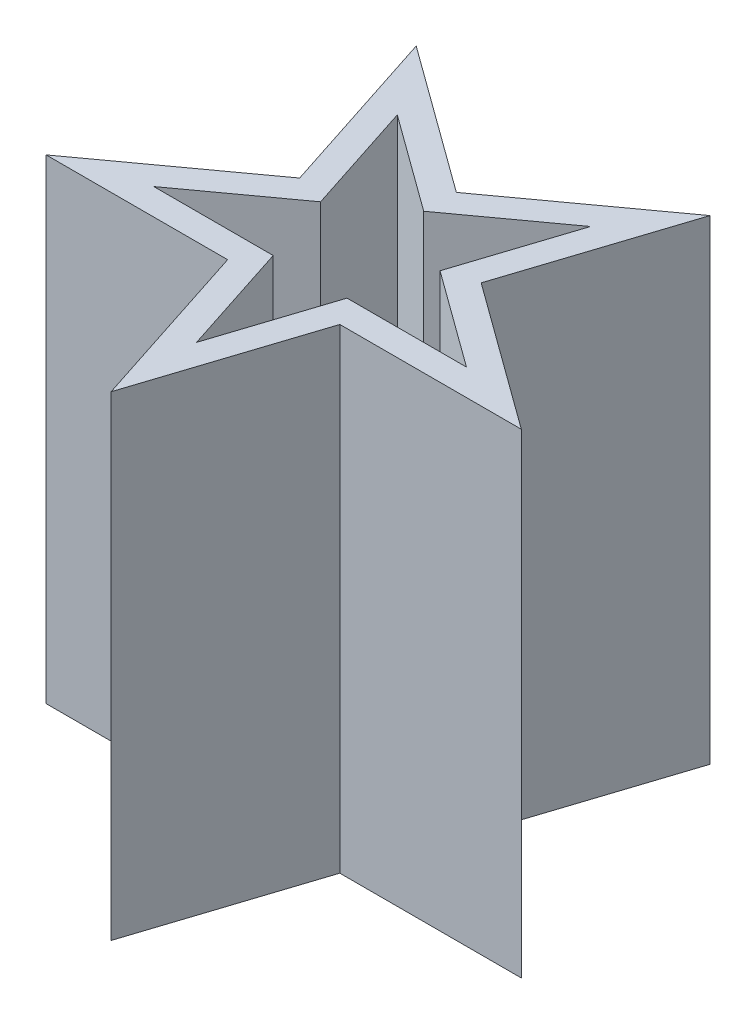
ISO-10303-21;
HEADER;
FILE_DESCRIPTION(('STEP AP214'),'2;1');
FILE_NAME('part.step','',(''),(''),'','','');
FILE_SCHEMA(('AUTOMOTIVE_DESIGN { 1 0 10303 214 1 1 1 1 }'));
ENDSEC;
DATA;
#1=APPLICATION_CONTEXT('core data for automotive mechanical design processes');
#2=APPLICATION_PROTOCOL_DEFINITION('international standard','automotive_design',2000,#1);
#3=PRODUCT_CONTEXT('',#1,'mechanical');
#4=PRODUCT('Part','Part','',(#3));
#5=PRODUCT_RELATED_PRODUCT_CATEGORY('part','',(#4));
#6=PRODUCT_DEFINITION_FORMATION('','',#4);
#7=PRODUCT_DEFINITION_CONTEXT('part definition',#1,'design');
#8=PRODUCT_DEFINITION('design','',#6,#7);
#9=PRODUCT_DEFINITION_SHAPE('','',#8);
#10=(LENGTH_UNIT() NAMED_UNIT(*) SI_UNIT(.MILLI.,.METRE.));
#11=(NAMED_UNIT(*) PLANE_ANGLE_UNIT() SI_UNIT($,.RADIAN.));
#12=(NAMED_UNIT(*) SI_UNIT($,.STERADIAN.) SOLID_ANGLE_UNIT());
#13=UNCERTAINTY_MEASURE_WITH_UNIT(LENGTH_MEASURE(1.E-05),#10,'distance_accuracy_value','');
#14=(GEOMETRIC_REPRESENTATION_CONTEXT(3) GLOBAL_UNCERTAINTY_ASSIGNED_CONTEXT((#13)) GLOBAL_UNIT_ASSIGNED_CONTEXT((#10,
#11,#12)) REPRESENTATION_CONTEXT('',''));
#15=CARTESIAN_POINT('',(0.,0.,0.));
#16=DIRECTION('',(0.,0.,1.));
#17=DIRECTION('',(1.,0.,0.));
#18=AXIS2_PLACEMENT_3D('',#15,#16,#17);
#19=CARTESIAN_POINT('',(0.,18.,9.4631600181444));
#20=DIRECTION('',(0.951056516295154,0.,-0.309016994374948));
#21=DIRECTION('',(-0.309016994374948,0.,-0.951056516295154));
#22=AXIS2_PLACEMENT_3D('',#19,#20,#21);
#23=PLANE('',#22);
#24=DIRECTION('',(0.309016994374948,0.,0.951056516295154));
#25=VECTOR('',#24,1.);
#26=CARTESIAN_POINT('',(0.,0.,9.4631600181444));
#27=LINE('',#26,#25);
#28=CARTESIAN_POINT('',(-2.12461179749811,0.,2.92427726609615));
#29=VERTEX_POINT('',#28);
#30=CARTESIAN_POINT('',(0.,0.,9.4631600181444));
#31=VERTEX_POINT('',#30);
#32=EDGE_CURVE('E165',#29,#31,#27,.T.);
#33=ORIENTED_EDGE('',*,*,#32,.T.);
#34=DIRECTION('',(0.,-1.,0.));
#35=VECTOR('',#34,1.);
#36=CARTESIAN_POINT('',(0.,18.,9.4631600181444));
#37=LINE('',#36,#35);
#38=CARTESIAN_POINT('',(0.,18.,9.4631600181444));
#39=VERTEX_POINT('',#38);
#40=EDGE_CURVE('E11',#39,#31,#37,.T.);
#41=ORIENTED_EDGE('',*,*,#40,.F.);
#42=DIRECTION('',(0.309016994374948,0.,0.951056516295154));
#43=VECTOR('',#42,1.);
#44=CARTESIAN_POINT('',(0.,18.,9.4631600181444));
#45=LINE('',#44,#43);
#46=CARTESIAN_POINT('',(-2.12461179749811,18.,2.92427726609615));
#47=VERTEX_POINT('',#46);
#48=EDGE_CURVE('E195',#47,#39,#45,.T.);
#49=ORIENTED_EDGE('',*,*,#48,.F.);
#50=DIRECTION('',(0.,-1.,0.));
#51=VECTOR('',#50,1.);
#52=CARTESIAN_POINT('',(-2.12461179749811,18.,2.92427726609615));
#53=LINE('',#52,#51);
#54=EDGE_CURVE('E161',#47,#29,#53,.T.);
#55=ORIENTED_EDGE('',*,*,#54,.T.);
#56=EDGE_LOOP('',(#33,#41,#49,#55));
#57=FACE_BOUND('',#56,.T.);
#58=ADVANCED_FACE('F41',(#57),#23,.F.);
#59=CARTESIAN_POINT('',(2.12461179749811,18.,2.92427726609615));
#60=DIRECTION('',(-0.951056516295154,0.,-0.309016994374947));
#61=DIRECTION('',(-0.309016994374948,0.,0.951056516295154));
#62=AXIS2_PLACEMENT_3D('',#59,#60,#61);
#63=PLANE('',#62);
#64=DIRECTION('',(0.309016994374947,0.,-0.951056516295154));
#65=VECTOR('',#64,1.);
#66=CARTESIAN_POINT('',(2.12461179749811,0.,2.92427726609615));
#67=LINE('',#66,#65);
#68=CARTESIAN_POINT('',(2.12461179749811,0.,2.92427726609615));
#69=VERTEX_POINT('',#68);
#70=EDGE_CURVE('E169',#31,#69,#67,.T.);
#71=ORIENTED_EDGE('',*,*,#70,.T.);
#72=DIRECTION('',(0.,-1.,0.));
#73=VECTOR('',#72,1.);
#74=CARTESIAN_POINT('',(2.12461179749811,18.,2.92427726609615));
#75=LINE('',#74,#73);
#76=CARTESIAN_POINT('',(2.12461179749811,18.,2.92427726609615));
#77=VERTEX_POINT('',#76);
#78=EDGE_CURVE('E49',#77,#69,#75,.T.);
#79=ORIENTED_EDGE('',*,*,#78,.F.);
#80=DIRECTION('',(0.309016994374947,0.,-0.951056516295154));
#81=VECTOR('',#80,1.);
#82=CARTESIAN_POINT('',(2.12461179749811,18.,2.92427726609615));
#83=LINE('',#82,#81);
#84=EDGE_CURVE('E112',#39,#77,#83,.T.);
#85=ORIENTED_EDGE('',*,*,#84,.F.);
#86=ORIENTED_EDGE('',*,*,#40,.T.);
#87=EDGE_LOOP('',(#71,#79,#85,#86));
#88=FACE_BOUND('',#87,.T.);
#89=ADVANCED_FACE('F449',(#88),#63,.F.);
#90=CARTESIAN_POINT('',(8.99999999999999,18.,2.92427726609615));
#91=DIRECTION('',(0.,0.,-1.));
#92=DIRECTION('',(-1.,0.,0.));
#93=AXIS2_PLACEMENT_3D('',#90,#91,#92);
#94=PLANE('',#93);
#95=DIRECTION('',(1.,0.,0.));
#96=VECTOR('',#95,1.);
#97=CARTESIAN_POINT('',(8.99999999999999,0.,2.92427726609615));
#98=LINE('',#97,#96);
#99=CARTESIAN_POINT('',(8.99999999999999,0.,2.92427726609615));
#100=VERTEX_POINT('',#99);
#101=EDGE_CURVE('E173',#69,#100,#98,.T.);
#102=ORIENTED_EDGE('',*,*,#101,.T.);
#103=DIRECTION('',(0.,-1.,0.));
#104=VECTOR('',#103,1.);
#105=CARTESIAN_POINT('',(8.99999999999999,18.,2.92427726609615));
#106=LINE('',#105,#104);
#107=CARTESIAN_POINT('',(8.99999999999999,18.,2.92427726609615));
#108=VERTEX_POINT('',#107);
#109=EDGE_CURVE('E214',#108,#100,#106,.T.);
#110=ORIENTED_EDGE('',*,*,#109,.F.);
#111=DIRECTION('',(1.,0.,0.));
#112=VECTOR('',#111,1.);
#113=CARTESIAN_POINT('',(8.99999999999999,18.,2.92427726609615));
#114=LINE('',#113,#112);
#115=EDGE_CURVE('E224',#77,#108,#114,.T.);
#116=ORIENTED_EDGE('',*,*,#115,.F.);
#117=ORIENTED_EDGE('',*,*,#78,.T.);
#118=EDGE_LOOP('',(#102,#110,#116,#117));
#119=FACE_BOUND('',#118,.T.);
#120=ADVANCED_FACE('F222',(#119),#94,.F.);
#121=CARTESIAN_POINT('',(3.43769410125095,18.,-1.11697452312008));
#122=DIRECTION('',(-0.587785252292471,0.,0.809016994374949));
#123=DIRECTION('',(0.809016994374949,0.,0.587785252292471));
#124=AXIS2_PLACEMENT_3D('',#121,#122,#123);
#125=PLANE('',#124);
#126=DIRECTION('',(-0.809016994374949,0.,-0.587785252292471));
#127=VECTOR('',#126,1.);
#128=CARTESIAN_POINT('',(3.43769410125095,0.,-1.11697452312008));
#129=LINE('',#128,#127);
#130=CARTESIAN_POINT('',(3.43769410125095,0.,-1.11697452312008));
#131=VERTEX_POINT('',#130);
#132=EDGE_CURVE('E176',#100,#131,#129,.T.);
#133=ORIENTED_EDGE('',*,*,#132,.T.);
#134=DIRECTION('',(0.,-1.,0.));
#135=VECTOR('',#134,1.);
#136=CARTESIAN_POINT('',(3.43769410125095,18.,-1.11697452312008));
#137=LINE('',#136,#135);
#138=CARTESIAN_POINT('',(3.43769410125095,18.,-1.11697452312008));
#139=VERTEX_POINT('',#138);
#140=EDGE_CURVE('E210',#139,#131,#137,.T.);
#141=ORIENTED_EDGE('',*,*,#140,.F.);
#142=DIRECTION('',(-0.809016994374949,0.,-0.587785252292471));
#143=VECTOR('',#142,1.);
#144=CARTESIAN_POINT('',(3.43769410125095,18.,-1.11697452312008));
#145=LINE('',#144,#143);
#146=EDGE_CURVE('E243',#108,#139,#145,.T.);
#147=ORIENTED_EDGE('',*,*,#146,.F.);
#148=ORIENTED_EDGE('',*,*,#109,.T.);
#149=EDGE_LOOP('',(#133,#141,#147,#148));
#150=FACE_BOUND('',#149,.T.);
#151=ADVANCED_FACE('F233',(#150),#125,.F.);
#152=CARTESIAN_POINT('',(5.56230589874905,18.,-7.65585727516836));
#153=DIRECTION('',(-0.951056516295155,0.,-0.309016994374945));
#154=DIRECTION('',(-0.309016994374945,0.,0.951056516295155));
#155=AXIS2_PLACEMENT_3D('',#152,#153,#154);
#156=PLANE('',#155);
#157=DIRECTION('',(0.309016994374945,0.,-0.951056516295154));
#158=VECTOR('',#157,1.);
#159=CARTESIAN_POINT('',(5.56230589874905,0.,-7.65585727516836));
#160=LINE('',#159,#158);
#161=CARTESIAN_POINT('',(5.56230589874905,0.,-7.65585727516836));
#162=VERTEX_POINT('',#161);
#163=EDGE_CURVE('E179',#131,#162,#160,.T.);
#164=ORIENTED_EDGE('',*,*,#163,.T.);
#165=DIRECTION('',(0.,-1.,0.));
#166=VECTOR('',#165,1.);
#167=CARTESIAN_POINT('',(5.56230589874905,18.,-7.65585727516836));
#168=LINE('',#167,#166);
#169=CARTESIAN_POINT('',(5.56230589874905,18.,-7.65585727516836));
#170=VERTEX_POINT('',#169);
#171=EDGE_CURVE('E206',#170,#162,#168,.T.);
#172=ORIENTED_EDGE('',*,*,#171,.F.);
#173=DIRECTION('',(0.309016994374945,0.,-0.951056516295154));
#174=VECTOR('',#173,1.);
#175=CARTESIAN_POINT('',(5.56230589874905,18.,-7.65585727516836));
#176=LINE('',#175,#174);
#177=EDGE_CURVE('E239',#139,#170,#176,.T.);
#178=ORIENTED_EDGE('',*,*,#177,.F.);
#179=ORIENTED_EDGE('',*,*,#140,.T.);
#180=EDGE_LOOP('',(#164,#172,#178,#179));
#181=FACE_BOUND('',#180,.T.);
#182=ADVANCED_FACE('F237',(#181),#156,.F.);
#183=CARTESIAN_POINT('',(0.,18.,-3.61460548595209));
#184=DIRECTION('',(0.587785252292473,0.,0.809016994374947));
#185=DIRECTION('',(0.809016994374947,0.,-0.587785252292473));
#186=AXIS2_PLACEMENT_3D('',#183,#184,#185);
#187=PLANE('',#186);
#188=DIRECTION('',(-0.809016994374947,0.,0.587785252292473));
#189=VECTOR('',#188,1.);
#190=CARTESIAN_POINT('',(0.,0.,-3.61460548595209));
#191=LINE('',#190,#189);
#192=CARTESIAN_POINT('',(0.,0.,-3.61460548595209));
#193=VERTEX_POINT('',#192);
#194=EDGE_CURVE('E182',#162,#193,#191,.T.);
#195=ORIENTED_EDGE('',*,*,#194,.T.);
#196=DIRECTION('',(0.,-1.,0.));
#197=VECTOR('',#196,1.);
#198=CARTESIAN_POINT('',(0.,18.,-3.61460548595209));
#199=LINE('',#198,#197);
#200=CARTESIAN_POINT('',(0.,18.,-3.61460548595209));
#201=VERTEX_POINT('',#200);
#202=EDGE_CURVE('E202',#201,#193,#199,.T.);
#203=ORIENTED_EDGE('',*,*,#202,.F.);
#204=DIRECTION('',(-0.809016994374947,0.,0.587785252292473));
#205=VECTOR('',#204,1.);
#206=CARTESIAN_POINT('',(0.,18.,-3.61460548595209));
#207=LINE('',#206,#205);
#208=EDGE_CURVE('E242',#170,#201,#207,.T.);
#209=ORIENTED_EDGE('',*,*,#208,.F.);
#210=ORIENTED_EDGE('',*,*,#171,.T.);
#211=EDGE_LOOP('',(#195,#203,#209,#210));
#212=FACE_BOUND('',#211,.T.);
#213=ADVANCED_FACE('F473',(#212),#187,.F.);
#214=CARTESIAN_POINT('',(-5.56230589874905,18.,-7.65585727516835));
#215=DIRECTION('',(-0.587785252292473,0.,0.809016994374948));
#216=DIRECTION('',(0.809016994374948,0.,0.587785252292473));
#217=AXIS2_PLACEMENT_3D('',#214,#215,#216);
#218=PLANE('',#217);
#219=DIRECTION('',(-0.809016994374948,0.,-0.587785252292473));
#220=VECTOR('',#219,1.);
#221=CARTESIAN_POINT('',(-5.56230589874905,0.,-7.65585727516835));
#222=LINE('',#221,#220);
#223=CARTESIAN_POINT('',(-5.56230589874905,0.,-7.65585727516835));
#224=VERTEX_POINT('',#223);
#225=EDGE_CURVE('E185',#193,#224,#222,.T.);
#226=ORIENTED_EDGE('',*,*,#225,.T.);
#227=DIRECTION('',(0.,-1.,0.));
#228=VECTOR('',#227,1.);
#229=CARTESIAN_POINT('',(-5.56230589874905,18.,-7.65585727516835));
#230=LINE('',#229,#228);
#231=CARTESIAN_POINT('',(-5.56230589874905,18.,-7.65585727516835));
#232=VERTEX_POINT('',#231);
#233=EDGE_CURVE('E154',#232,#224,#230,.T.);
#234=ORIENTED_EDGE('',*,*,#233,.F.);
#235=DIRECTION('',(-0.809016994374948,0.,-0.587785252292473));
#236=VECTOR('',#235,1.);
#237=CARTESIAN_POINT('',(-5.56230589874905,18.,-7.65585727516835));
#238=LINE('',#237,#236);
#239=EDGE_CURVE('E140',#201,#232,#238,.T.);
#240=ORIENTED_EDGE('',*,*,#239,.F.);
#241=ORIENTED_EDGE('',*,*,#202,.T.);
#242=EDGE_LOOP('',(#226,#234,#240,#241));
#243=FACE_BOUND('',#242,.T.);
#244=ADVANCED_FACE('F470',(#243),#218,.F.);
#245=CARTESIAN_POINT('',(-3.43769410125094,18.,-1.11697452312012));
#246=DIRECTION('',(0.951056516295153,0.,-0.309016994374949));
#247=DIRECTION('',(-0.309016994374949,0.,-0.951056516295153));
#248=AXIS2_PLACEMENT_3D('',#245,#246,#247);
#249=PLANE('',#248);
#250=DIRECTION('',(0.309016994374948,0.,0.951056516295153));
#251=VECTOR('',#250,1.);
#252=CARTESIAN_POINT('',(-3.43769410125094,0.,-1.11697452312012));
#253=LINE('',#252,#251);
#254=CARTESIAN_POINT('',(-3.43769410125094,0.,-1.11697452312012));
#255=VERTEX_POINT('',#254);
#256=EDGE_CURVE('E150',#224,#255,#253,.T.);
#257=ORIENTED_EDGE('',*,*,#256,.T.);
#258=DIRECTION('',(0.,-1.,0.));
#259=VECTOR('',#258,1.);
#260=CARTESIAN_POINT('',(-3.43769410125094,18.,-1.11697452312012));
#261=LINE('',#260,#259);
#262=CARTESIAN_POINT('',(-3.43769410125094,18.,-1.11697452312012));
#263=VERTEX_POINT('',#262);
#264=EDGE_CURVE('E147',#263,#255,#261,.T.);
#265=ORIENTED_EDGE('',*,*,#264,.F.);
#266=DIRECTION('',(0.309016994374948,0.,0.951056516295153));
#267=VECTOR('',#266,1.);
#268=CARTESIAN_POINT('',(-3.43769410125094,18.,-1.11697452312012));
#269=LINE('',#268,#267);
#270=EDGE_CURVE('E133',#232,#263,#269,.T.);
#271=ORIENTED_EDGE('',*,*,#270,.F.);
#272=ORIENTED_EDGE('',*,*,#233,.T.);
#273=EDGE_LOOP('',(#257,#265,#271,#272));
#274=FACE_BOUND('',#273,.T.);
#275=ADVANCED_FACE('F148',(#274),#249,.F.);
#276=CARTESIAN_POINT('',(-9.00000000000001,18.,2.92427726609613));
#277=DIRECTION('',(0.587785252292471,0.,0.809016994374949));
#278=DIRECTION('',(0.809016994374949,0.,-0.587785252292471));
#279=AXIS2_PLACEMENT_3D('',#276,#277,#278);
#280=PLANE('',#279);
#281=DIRECTION('',(-0.809016994374949,0.,0.587785252292471));
#282=VECTOR('',#281,1.);
#283=CARTESIAN_POINT('',(-9.00000000000001,0.,2.92427726609613));
#284=LINE('',#283,#282);
#285=CARTESIAN_POINT('',(-9.00000000000001,0.,2.92427726609613));
#286=VERTEX_POINT('',#285);
#287=EDGE_CURVE('E190',#255,#286,#284,.T.);
#288=ORIENTED_EDGE('',*,*,#287,.T.);
#289=DIRECTION('',(0.,-1.,0.));
#290=VECTOR('',#289,1.);
#291=CARTESIAN_POINT('',(-9.00000000000001,18.,2.92427726609613));
#292=LINE('',#291,#290);
#293=CARTESIAN_POINT('',(-9.00000000000001,18.,2.92427726609613));
#294=VERTEX_POINT('',#293);
#295=EDGE_CURVE('E155',#294,#286,#292,.T.);
#296=ORIENTED_EDGE('',*,*,#295,.F.);
#297=DIRECTION('',(-0.809016994374949,0.,0.587785252292471));
#298=VECTOR('',#297,1.);
#299=CARTESIAN_POINT('',(-9.00000000000001,18.,2.92427726609613));
#300=LINE('',#299,#298);
#301=EDGE_CURVE('E137',#263,#294,#300,.T.);
#302=ORIENTED_EDGE('',*,*,#301,.F.);
#303=ORIENTED_EDGE('',*,*,#264,.T.);
#304=EDGE_LOOP('',(#288,#296,#302,#303));
#305=FACE_BOUND('',#304,.T.);
#306=ADVANCED_FACE('F157',(#305),#280,.F.);
#307=CARTESIAN_POINT('',(-2.12461179749811,18.,2.92427726609615));
#308=DIRECTION('',(0.,0.,-1.));
#309=DIRECTION('',(-1.,0.,0.));
#310=AXIS2_PLACEMENT_3D('',#307,#308,#309);
#311=PLANE('',#310);
#312=DIRECTION('',(1.,0.,0.));
#313=VECTOR('',#312,1.);
#314=CARTESIAN_POINT('',(-2.12461179749811,0.,2.92427726609615));
#315=LINE('',#314,#313);
#316=EDGE_CURVE('E104',#286,#29,#315,.T.);
#317=ORIENTED_EDGE('',*,*,#316,.T.);
#318=ORIENTED_EDGE('',*,*,#54,.F.);
#319=DIRECTION('',(1.,0.,0.));
#320=VECTOR('',#319,1.);
#321=CARTESIAN_POINT('',(-2.12461179749811,18.,2.92427726609615));
#322=LINE('',#321,#320);
#323=EDGE_CURVE('E65',#294,#47,#322,.T.);
#324=ORIENTED_EDGE('',*,*,#323,.F.);
#325=ORIENTED_EDGE('',*,*,#295,.T.);
#326=EDGE_LOOP('',(#317,#318,#324,#325));
#327=FACE_BOUND('',#326,.T.);
#328=ADVANCED_FACE('F457',(#327),#311,.F.);
#329=CARTESIAN_POINT('',(0.,18.,0.));
#330=DIRECTION('',(0.,1.,0.));
#331=DIRECTION('',(0.,0.,1.));
#332=AXIS2_PLACEMENT_3D('',#329,#330,#331);
#333=PLANE('',#332);
#334=DIRECTION('',(0.309016994374948,0.,0.951056516295154));
#335=VECTOR('',#334,1.);
#336=CARTESIAN_POINT('',(0.951056516295154,18.,9.15414302376945));
#337=LINE('',#336,#335);
#338=CARTESIAN_POINT('',(-1.39806926949274,18.,1.92427726609616));
#339=VERTEX_POINT('',#338);
#340=CARTESIAN_POINT('',(0.,18.,6.22709204064461));
#341=VERTEX_POINT('',#340);
#342=EDGE_CURVE('E292',#339,#341,#337,.T.);
#343=ORIENTED_EDGE('',*,*,#342,.F.);
#344=DIRECTION('',(1.,0.,0.));
#345=VECTOR('',#344,1.);
#346=CARTESIAN_POINT('',(-2.1246117974981,18.,1.92427726609615));
#347=LINE('',#346,#345);
#348=CARTESIAN_POINT('',(-5.92231646282475,18.,1.92427726609614));
#349=VERTEX_POINT('',#348);
#350=EDGE_CURVE('E257',#349,#339,#347,.T.);
#351=ORIENTED_EDGE('',*,*,#350,.F.);
#352=DIRECTION('',(-0.809016994374949,0.,0.587785252292471));
#353=VECTOR('',#352,1.);
#354=CARTESIAN_POINT('',(-8.41221474770753,18.,3.73329426047108));
#355=LINE('',#354,#353);
#356=CARTESIAN_POINT('',(-2.26212359666599,18.,-0.735008511870014));
#357=VERTEX_POINT('',#356);
#358=EDGE_CURVE('E261',#357,#349,#355,.T.);
#359=ORIENTED_EDGE('',*,*,#358,.F.);
#360=DIRECTION('',(0.309016994374949,0.,0.951056516295153));
#361=VECTOR('',#360,1.);
#362=CARTESIAN_POINT('',(-2.48663758495579,18.,-1.42599151749507));
#363=LINE('',#362,#361);
#364=CARTESIAN_POINT('',(-3.66019286615874,18.,-5.03782328641846));
#365=VERTEX_POINT('',#364);
#366=EDGE_CURVE('E264',#365,#357,#363,.T.);
#367=ORIENTED_EDGE('',*,*,#366,.F.);
#368=DIRECTION('',(-0.809016994374948,0.,-0.587785252292473));
#369=VECTOR('',#368,1.);
#370=CARTESIAN_POINT('',(-6.15009115104152,18.,-6.84684028079341));
#371=LINE('',#370,#369);
#372=CARTESIAN_POINT('',(0.,18.,-2.3785375084523));
#373=VERTEX_POINT('',#372);
#374=EDGE_CURVE('E268',#373,#365,#371,.T.);
#375=ORIENTED_EDGE('',*,*,#374,.F.);
#376=DIRECTION('',(-0.809016994374947,0.,0.587785252292473));
#377=VECTOR('',#376,1.);
#378=CARTESIAN_POINT('',(0.587785252292472,18.,-2.80558849157714));
#379=LINE('',#378,#377);
#380=CARTESIAN_POINT('',(3.66019286615875,18.,-5.03782328641847));
#381=VERTEX_POINT('',#380);
#382=EDGE_CURVE('E272',#381,#373,#379,.T.);
#383=ORIENTED_EDGE('',*,*,#382,.F.);
#384=DIRECTION('',(0.309016994374945,0.,-0.951056516295155));
#385=VECTOR('',#384,1.);
#386=CARTESIAN_POINT('',(4.61124938245389,18.,-7.9648742695433));
#387=LINE('',#386,#385);
#388=CARTESIAN_POINT('',(2.26212359666601,18.,-0.735008511869972));
#389=VERTEX_POINT('',#388);
#390=EDGE_CURVE('E276',#389,#381,#387,.T.);
#391=ORIENTED_EDGE('',*,*,#390,.F.);
#392=DIRECTION('',(-0.809016994374949,0.,-0.587785252292471));
#393=VECTOR('',#392,1.);
#394=CARTESIAN_POINT('',(2.84990884895848,18.,-0.307957528745132));
#395=LINE('',#394,#393);
#396=CARTESIAN_POINT('',(5.92231646282472,18.,1.92427726609615));
#397=VERTEX_POINT('',#396);
#398=EDGE_CURVE('E280',#397,#389,#395,.T.);
#399=ORIENTED_EDGE('',*,*,#398,.F.);
#400=DIRECTION('',(1.,0.,0.));
#401=VECTOR('',#400,1.);
#402=CARTESIAN_POINT('',(8.99999999999999,18.,1.92427726609615));
#403=LINE('',#402,#401);
#404=CARTESIAN_POINT('',(1.39806926949275,18.,1.92427726609615));
#405=VERTEX_POINT('',#404);
#406=EDGE_CURVE('E284',#405,#397,#403,.T.);
#407=ORIENTED_EDGE('',*,*,#406,.F.);
#408=DIRECTION('',(0.309016994374948,0.,-0.951056516295154));
#409=VECTOR('',#408,1.);
#410=CARTESIAN_POINT('',(1.17355528120295,18.,2.6152602717212));
#411=LINE('',#410,#409);
#412=EDGE_CURVE('E288',#341,#405,#411,.T.);
#413=ORIENTED_EDGE('',*,*,#412,.F.);
#414=EDGE_LOOP('',(#343,#351,#359,#367,#375,#383,#391,#399,#407,#413));
#415=FACE_BOUND('',#414,.T.);
#416=ORIENTED_EDGE('',*,*,#48,.T.);
#417=ORIENTED_EDGE('',*,*,#84,.T.);
#418=ORIENTED_EDGE('',*,*,#115,.T.);
#419=ORIENTED_EDGE('',*,*,#146,.T.);
#420=ORIENTED_EDGE('',*,*,#177,.T.);
#421=ORIENTED_EDGE('',*,*,#208,.T.);
#422=ORIENTED_EDGE('',*,*,#239,.T.);
#423=ORIENTED_EDGE('',*,*,#270,.T.);
#424=ORIENTED_EDGE('',*,*,#301,.T.);
#425=ORIENTED_EDGE('',*,*,#323,.T.);
#426=EDGE_LOOP('',(#416,#417,#418,#419,#420,#421,#422,#423,#424,#425));
#427=FACE_BOUND('',#426,.T.);
#428=ADVANCED_FACE('F135',(#415,#427),#333,.T.);
#429=CARTESIAN_POINT('',(0.,0.,0.));
#430=DIRECTION('',(0.,1.,0.));
#431=DIRECTION('',(0.,0.,1.));
#432=AXIS2_PLACEMENT_3D('',#429,#430,#431);
#433=PLANE('',#432);
#434=ORIENTED_EDGE('',*,*,#32,.F.);
#435=ORIENTED_EDGE('',*,*,#316,.F.);
#436=ORIENTED_EDGE('',*,*,#287,.F.);
#437=ORIENTED_EDGE('',*,*,#256,.F.);
#438=ORIENTED_EDGE('',*,*,#225,.F.);
#439=ORIENTED_EDGE('',*,*,#194,.F.);
#440=ORIENTED_EDGE('',*,*,#163,.F.);
#441=ORIENTED_EDGE('',*,*,#132,.F.);
#442=ORIENTED_EDGE('',*,*,#101,.F.);
#443=ORIENTED_EDGE('',*,*,#70,.F.);
#444=EDGE_LOOP('',(#434,#435,#436,#437,#438,#439,#440,#441,#442,#443));
#445=FACE_BOUND('',#444,.T.);
#446=ADVANCED_FACE('F228',(#445),#433,.F.);
#447=CARTESIAN_POINT('',(0.951056516295154,18.,9.15414302376945));
#448=DIRECTION('',(0.951056516295154,0.,-0.309016994374948));
#449=DIRECTION('',(-0.309016994374948,0.,-0.951056516295154));
#450=AXIS2_PLACEMENT_3D('',#447,#448,#449);
#451=PLANE('',#450);
#452=DIRECTION('',(0.309016994374948,0.,0.951056516295154));
#453=VECTOR('',#452,1.);
#454=CARTESIAN_POINT('',(0.951056516295154,1.,9.15414302376945));
#455=LINE('',#454,#453);
#456=CARTESIAN_POINT('',(-1.39806926949274,1.,1.92427726609616));
#457=VERTEX_POINT('',#456);
#458=CARTESIAN_POINT('',(0.,1.,6.22709204064461));
#459=VERTEX_POINT('',#458);
#460=EDGE_CURVE('E362',#457,#459,#455,.T.);
#461=ORIENTED_EDGE('',*,*,#460,.F.);
#462=DIRECTION('',(0.,-1.,0.));
#463=VECTOR('',#462,1.);
#464=CARTESIAN_POINT('',(-1.39806926949274,18.,1.92427726609616));
#465=LINE('',#464,#463);
#466=EDGE_CURVE('E260',#339,#457,#465,.T.);
#467=ORIENTED_EDGE('',*,*,#466,.F.);
#468=ORIENTED_EDGE('',*,*,#342,.T.);
#469=DIRECTION('',(0.,-1.,0.));
#470=VECTOR('',#469,1.);
#471=CARTESIAN_POINT('',(0.,18.,6.22709204064461));
#472=LINE('',#471,#470);
#473=EDGE_CURVE('E170',#341,#459,#472,.T.);
#474=ORIENTED_EDGE('',*,*,#473,.T.);
#475=EDGE_LOOP('',(#461,#467,#468,#474));
#476=FACE_BOUND('',#475,.T.);
#477=ADVANCED_FACE('F381',(#476),#451,.T.);
#478=CARTESIAN_POINT('',(1.17355528120295,18.,2.6152602717212));
#479=DIRECTION('',(-0.951056516295154,0.,-0.309016994374947));
#480=DIRECTION('',(-0.309016994374948,0.,0.951056516295154));
#481=AXIS2_PLACEMENT_3D('',#478,#479,#480);
#482=PLANE('',#481);
#483=DIRECTION('',(0.309016994374948,0.,-0.951056516295154));
#484=VECTOR('',#483,1.);
#485=CARTESIAN_POINT('',(1.17355528120295,1.,2.6152602717212));
#486=LINE('',#485,#484);
#487=CARTESIAN_POINT('',(1.39806926949275,1.,1.92427726609615));
#488=VERTEX_POINT('',#487);
#489=EDGE_CURVE('E355',#459,#488,#486,.T.);
#490=ORIENTED_EDGE('',*,*,#489,.F.);
#491=ORIENTED_EDGE('',*,*,#473,.F.);
#492=ORIENTED_EDGE('',*,*,#412,.T.);
#493=DIRECTION('',(0.,-1.,0.));
#494=VECTOR('',#493,1.);
#495=CARTESIAN_POINT('',(1.39806926949275,18.,1.92427726609615));
#496=LINE('',#495,#494);
#497=EDGE_CURVE('E351',#405,#488,#496,.T.);
#498=ORIENTED_EDGE('',*,*,#497,.T.);
#499=EDGE_LOOP('',(#490,#491,#492,#498));
#500=FACE_BOUND('',#499,.T.);
#501=ADVANCED_FACE('F415',(#500),#482,.T.);
#502=CARTESIAN_POINT('',(8.99999999999999,18.,1.92427726609615));
#503=DIRECTION('',(0.,0.,-1.));
#504=DIRECTION('',(-1.,0.,0.));
#505=AXIS2_PLACEMENT_3D('',#502,#503,#504);
#506=PLANE('',#505);
#507=DIRECTION('',(1.,0.,0.));
#508=VECTOR('',#507,1.);
#509=CARTESIAN_POINT('',(8.99999999999999,1.,1.92427726609615));
#510=LINE('',#509,#508);
#511=CARTESIAN_POINT('',(5.92231646282472,1.,1.92427726609615));
#512=VERTEX_POINT('',#511);
#513=EDGE_CURVE('E347',#488,#512,#510,.T.);
#514=ORIENTED_EDGE('',*,*,#513,.F.);
#515=ORIENTED_EDGE('',*,*,#497,.F.);
#516=ORIENTED_EDGE('',*,*,#406,.T.);
#517=DIRECTION('',(0.,-1.,0.));
#518=VECTOR('',#517,1.);
#519=CARTESIAN_POINT('',(5.92231646282472,18.,1.92427726609615));
#520=LINE('',#519,#518);
#521=EDGE_CURVE('E343',#397,#512,#520,.T.);
#522=ORIENTED_EDGE('',*,*,#521,.T.);
#523=EDGE_LOOP('',(#514,#515,#516,#522));
#524=FACE_BOUND('',#523,.T.);
#525=ADVANCED_FACE('F421',(#524),#506,.T.);
#526=CARTESIAN_POINT('',(2.84990884895848,18.,-0.307957528745132));
#527=DIRECTION('',(-0.587785252292471,0.,0.809016994374949));
#528=DIRECTION('',(0.809016994374949,0.,0.587785252292471));
#529=AXIS2_PLACEMENT_3D('',#526,#527,#528);
#530=PLANE('',#529);
#531=DIRECTION('',(-0.809016994374949,0.,-0.587785252292471));
#532=VECTOR('',#531,1.);
#533=CARTESIAN_POINT('',(2.84990884895848,1.,-0.307957528745132));
#534=LINE('',#533,#532);
#535=CARTESIAN_POINT('',(2.26212359666601,1.,-0.735008511869972));
#536=VERTEX_POINT('',#535);
#537=EDGE_CURVE('E339',#512,#536,#534,.T.);
#538=ORIENTED_EDGE('',*,*,#537,.F.);
#539=ORIENTED_EDGE('',*,*,#521,.F.);
#540=ORIENTED_EDGE('',*,*,#398,.T.);
#541=DIRECTION('',(0.,-1.,0.));
#542=VECTOR('',#541,1.);
#543=CARTESIAN_POINT('',(2.26212359666601,18.,-0.735008511869972));
#544=LINE('',#543,#542);
#545=EDGE_CURVE('E335',#389,#536,#544,.T.);
#546=ORIENTED_EDGE('',*,*,#545,.T.);
#547=EDGE_LOOP('',(#538,#539,#540,#546));
#548=FACE_BOUND('',#547,.T.);
#549=ADVANCED_FACE('F572',(#548),#530,.T.);
#550=CARTESIAN_POINT('',(4.61124938245389,18.,-7.9648742695433));
#551=DIRECTION('',(-0.951056516295155,0.,-0.309016994374945));
#552=DIRECTION('',(-0.309016994374945,0.,0.951056516295155));
#553=AXIS2_PLACEMENT_3D('',#550,#551,#552);
#554=PLANE('',#553);
#555=DIRECTION('',(0.309016994374945,0.,-0.951056516295155));
#556=VECTOR('',#555,1.);
#557=CARTESIAN_POINT('',(4.61124938245389,1.,-7.9648742695433));
#558=LINE('',#557,#556);
#559=CARTESIAN_POINT('',(3.66019286615875,1.,-5.03782328641847));
#560=VERTEX_POINT('',#559);
#561=EDGE_CURVE('E331',#536,#560,#558,.T.);
#562=ORIENTED_EDGE('',*,*,#561,.F.);
#563=ORIENTED_EDGE('',*,*,#545,.F.);
#564=ORIENTED_EDGE('',*,*,#390,.T.);
#565=DIRECTION('',(0.,-1.,0.));
#566=VECTOR('',#565,1.);
#567=CARTESIAN_POINT('',(3.66019286615875,18.,-5.03782328641847));
#568=LINE('',#567,#566);
#569=EDGE_CURVE('E327',#381,#560,#568,.T.);
#570=ORIENTED_EDGE('',*,*,#569,.T.);
#571=EDGE_LOOP('',(#562,#563,#564,#570));
#572=FACE_BOUND('',#571,.T.);
#573=ADVANCED_FACE('F581',(#572),#554,.T.);
#574=CARTESIAN_POINT('',(0.587785252292472,18.,-2.80558849157714));
#575=DIRECTION('',(0.587785252292473,0.,0.809016994374947));
#576=DIRECTION('',(0.809016994374947,0.,-0.587785252292473));
#577=AXIS2_PLACEMENT_3D('',#574,#575,#576);
#578=PLANE('',#577);
#579=DIRECTION('',(-0.809016994374947,0.,0.587785252292473));
#580=VECTOR('',#579,1.);
#581=CARTESIAN_POINT('',(0.587785252292472,1.,-2.80558849157714));
#582=LINE('',#581,#580);
#583=CARTESIAN_POINT('',(0.,1.,-2.3785375084523));
#584=VERTEX_POINT('',#583);
#585=EDGE_CURVE('E323',#560,#584,#582,.T.);
#586=ORIENTED_EDGE('',*,*,#585,.F.);
#587=ORIENTED_EDGE('',*,*,#569,.F.);
#588=ORIENTED_EDGE('',*,*,#382,.T.);
#589=DIRECTION('',(0.,-1.,0.));
#590=VECTOR('',#589,1.);
#591=CARTESIAN_POINT('',(0.,18.,-2.3785375084523));
#592=LINE('',#591,#590);
#593=EDGE_CURVE('E319',#373,#584,#592,.T.);
#594=ORIENTED_EDGE('',*,*,#593,.T.);
#595=EDGE_LOOP('',(#586,#587,#588,#594));
#596=FACE_BOUND('',#595,.T.);
#597=ADVANCED_FACE('F592',(#596),#578,.T.);
#598=CARTESIAN_POINT('',(-6.15009115104152,18.,-6.84684028079341));
#599=DIRECTION('',(-0.587785252292473,0.,0.809016994374948));
#600=DIRECTION('',(0.809016994374948,0.,0.587785252292473));
#601=AXIS2_PLACEMENT_3D('',#598,#599,#600);
#602=PLANE('',#601);
#603=DIRECTION('',(-0.809016994374948,0.,-0.587785252292473));
#604=VECTOR('',#603,1.);
#605=CARTESIAN_POINT('',(-6.15009115104152,1.,-6.84684028079341));
#606=LINE('',#605,#604);
#607=CARTESIAN_POINT('',(-3.66019286615874,1.,-5.03782328641846));
#608=VERTEX_POINT('',#607);
#609=EDGE_CURVE('E315',#584,#608,#606,.T.);
#610=ORIENTED_EDGE('',*,*,#609,.F.);
#611=ORIENTED_EDGE('',*,*,#593,.F.);
#612=ORIENTED_EDGE('',*,*,#374,.T.);
#613=DIRECTION('',(0.,-1.,0.));
#614=VECTOR('',#613,1.);
#615=CARTESIAN_POINT('',(-3.66019286615874,18.,-5.03782328641846));
#616=LINE('',#615,#614);
#617=EDGE_CURVE('E311',#365,#608,#616,.T.);
#618=ORIENTED_EDGE('',*,*,#617,.T.);
#619=EDGE_LOOP('',(#610,#611,#612,#618));
#620=FACE_BOUND('',#619,.T.);
#621=ADVANCED_FACE('F446',(#620),#602,.T.);
#622=CARTESIAN_POINT('',(-2.48663758495579,18.,-1.42599151749507));
#623=DIRECTION('',(0.951056516295153,0.,-0.309016994374949));
#624=DIRECTION('',(-0.309016994374949,0.,-0.951056516295153));
#625=AXIS2_PLACEMENT_3D('',#622,#623,#624);
#626=PLANE('',#625);
#627=DIRECTION('',(0.309016994374949,0.,0.951056516295153));
#628=VECTOR('',#627,1.);
#629=CARTESIAN_POINT('',(-2.48663758495579,1.,-1.42599151749507));
#630=LINE('',#629,#628);
#631=CARTESIAN_POINT('',(-2.26212359666599,1.,-0.735008511870014));
#632=VERTEX_POINT('',#631);
#633=EDGE_CURVE('E307',#608,#632,#630,.T.);
#634=ORIENTED_EDGE('',*,*,#633,.F.);
#635=ORIENTED_EDGE('',*,*,#617,.F.);
#636=ORIENTED_EDGE('',*,*,#366,.T.);
#637=DIRECTION('',(0.,-1.,0.));
#638=VECTOR('',#637,1.);
#639=CARTESIAN_POINT('',(-2.26212359666599,18.,-0.735008511870013));
#640=LINE('',#639,#638);
#641=EDGE_CURVE('E303',#357,#632,#640,.T.);
#642=ORIENTED_EDGE('',*,*,#641,.T.);
#643=EDGE_LOOP('',(#634,#635,#636,#642));
#644=FACE_BOUND('',#643,.T.);
#645=ADVANCED_FACE('F436',(#644),#626,.T.);
#646=CARTESIAN_POINT('',(-8.41221474770753,18.,3.73329426047108));
#647=DIRECTION('',(0.587785252292471,0.,0.809016994374949));
#648=DIRECTION('',(0.809016994374949,0.,-0.587785252292471));
#649=AXIS2_PLACEMENT_3D('',#646,#647,#648);
#650=PLANE('',#649);
#651=DIRECTION('',(-0.809016994374949,0.,0.587785252292471));
#652=VECTOR('',#651,1.);
#653=CARTESIAN_POINT('',(-8.41221474770753,1.,3.73329426047108));
#654=LINE('',#653,#652);
#655=CARTESIAN_POINT('',(-5.92231646282475,1.,1.92427726609614));
#656=VERTEX_POINT('',#655);
#657=EDGE_CURVE('E300',#632,#656,#654,.T.);
#658=ORIENTED_EDGE('',*,*,#657,.F.);
#659=ORIENTED_EDGE('',*,*,#641,.F.);
#660=ORIENTED_EDGE('',*,*,#358,.T.);
#661=DIRECTION('',(0.,-1.,0.));
#662=VECTOR('',#661,1.);
#663=CARTESIAN_POINT('',(-5.92231646282475,18.,1.92427726609614));
#664=LINE('',#663,#662);
#665=EDGE_CURVE('E56',#349,#656,#664,.T.);
#666=ORIENTED_EDGE('',*,*,#665,.T.);
#667=EDGE_LOOP('',(#658,#659,#660,#666));
#668=FACE_BOUND('',#667,.T.);
#669=ADVANCED_FACE('F438',(#668),#650,.T.);
#670=CARTESIAN_POINT('',(-2.1246117974981,18.,1.92427726609615));
#671=DIRECTION('',(0.,0.,-1.));
#672=DIRECTION('',(-1.,0.,0.));
#673=AXIS2_PLACEMENT_3D('',#670,#671,#672);
#674=PLANE('',#673);
#675=DIRECTION('',(1.,0.,0.));
#676=VECTOR('',#675,1.);
#677=CARTESIAN_POINT('',(-2.1246117974981,1.,1.92427726609615));
#678=LINE('',#677,#676);
#679=EDGE_CURVE('E296',#656,#457,#678,.T.);
#680=ORIENTED_EDGE('',*,*,#679,.F.);
#681=ORIENTED_EDGE('',*,*,#665,.F.);
#682=ORIENTED_EDGE('',*,*,#350,.T.);
#683=ORIENTED_EDGE('',*,*,#466,.T.);
#684=EDGE_LOOP('',(#680,#681,#682,#683));
#685=FACE_BOUND('',#684,.T.);
#686=ADVANCED_FACE('F409',(#685),#674,.T.);
#687=CARTESIAN_POINT('',(0.,1.,0.));
#688=DIRECTION('',(0.,1.,0.));
#689=DIRECTION('',(0.,0.,1.));
#690=AXIS2_PLACEMENT_3D('',#687,#688,#689);
#691=PLANE('',#690);
#692=ORIENTED_EDGE('',*,*,#460,.T.);
#693=ORIENTED_EDGE('',*,*,#489,.T.);
#694=ORIENTED_EDGE('',*,*,#513,.T.);
#695=ORIENTED_EDGE('',*,*,#537,.T.);
#696=ORIENTED_EDGE('',*,*,#561,.T.);
#697=ORIENTED_EDGE('',*,*,#585,.T.);
#698=ORIENTED_EDGE('',*,*,#609,.T.);
#699=ORIENTED_EDGE('',*,*,#633,.T.);
#700=ORIENTED_EDGE('',*,*,#657,.T.);
#701=ORIENTED_EDGE('',*,*,#679,.T.);
#702=EDGE_LOOP('',(#692,#693,#694,#695,#696,#697,#698,#699,#700,#701));
#703=FACE_BOUND('',#702,.T.);
#704=ADVANCED_FACE('F374',(#703),#691,.T.);
#705=CLOSED_SHELL('',(#58,#89,#120,#151,#182,#213,#244,#275,#306,#328,#428,#446,#477,#501,#525,
#549,#573,#597,#621,#645,#669,#686,#704));
#706=MANIFOLD_SOLID_BREP('B2',#705);
#707=ADVANCED_BREP_SHAPE_REPRESENTATION('',(#18,#706),#14);
#708=SHAPE_DEFINITION_REPRESENTATION(#9,#707);
ENDSEC;
END-ISO-10303-21;
